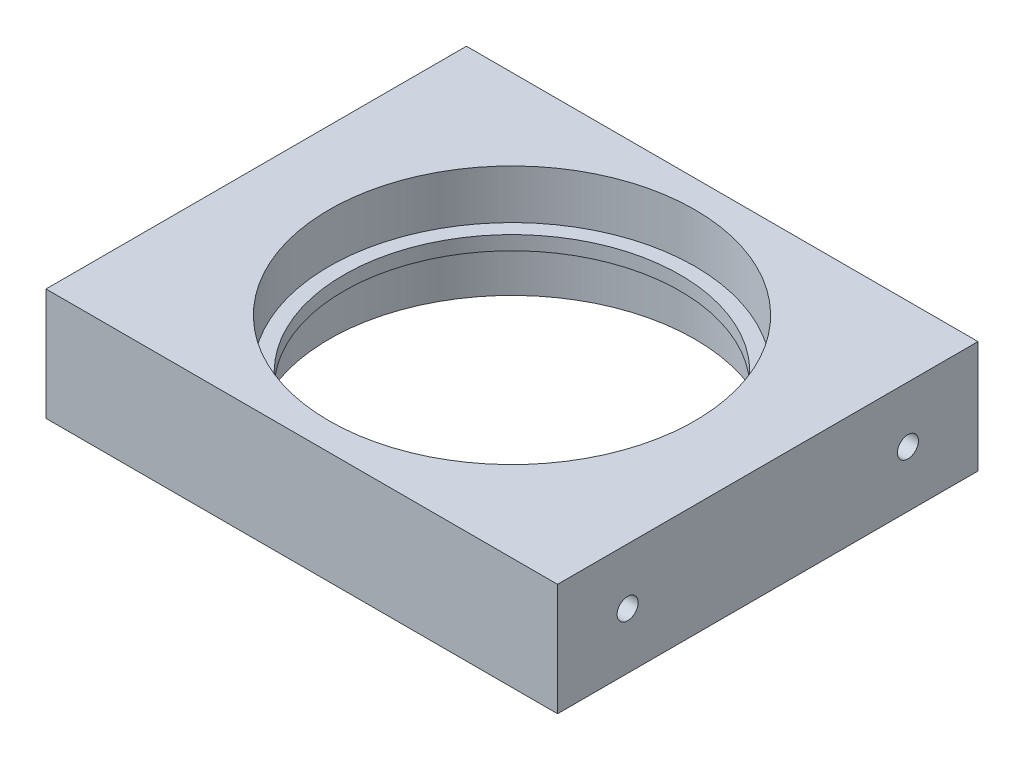
ISO-10303-21;
HEADER;
FILE_DESCRIPTION(('STEP AP214'),'2;1');
FILE_NAME('part.step','',(''),(''),'','','');
FILE_SCHEMA(('AUTOMOTIVE_DESIGN { 1 0 10303 214 1 1 1 1 }'));
ENDSEC;
DATA;
#1=APPLICATION_CONTEXT('core data for automotive mechanical design processes');
#2=APPLICATION_PROTOCOL_DEFINITION('international standard','automotive_design',2000,#1);
#3=PRODUCT_CONTEXT('',#1,'mechanical');
#4=PRODUCT('Part','Part','',(#3));
#5=PRODUCT_RELATED_PRODUCT_CATEGORY('part','',(#4));
#6=PRODUCT_DEFINITION_FORMATION('','',#4);
#7=PRODUCT_DEFINITION_CONTEXT('part definition',#1,'design');
#8=PRODUCT_DEFINITION('design','',#6,#7);
#9=PRODUCT_DEFINITION_SHAPE('','',#8);
#10=(LENGTH_UNIT() NAMED_UNIT(*) SI_UNIT(.MILLI.,.METRE.));
#11=(NAMED_UNIT(*) PLANE_ANGLE_UNIT() SI_UNIT($,.RADIAN.));
#12=(NAMED_UNIT(*) SI_UNIT($,.STERADIAN.) SOLID_ANGLE_UNIT());
#13=UNCERTAINTY_MEASURE_WITH_UNIT(LENGTH_MEASURE(1.E-05),#10,'distance_accuracy_value','');
#14=(GEOMETRIC_REPRESENTATION_CONTEXT(3) GLOBAL_UNCERTAINTY_ASSIGNED_CONTEXT((#13)) GLOBAL_UNIT_ASSIGNED_CONTEXT((#10,
#11,#12)) REPRESENTATION_CONTEXT('',''));
#15=CARTESIAN_POINT('',(0.,0.,0.));
#16=DIRECTION('',(0.,0.,1.));
#17=DIRECTION('',(1.,0.,0.));
#18=AXIS2_PLACEMENT_3D('',#15,#16,#17);
#19=CARTESIAN_POINT('',(36.5,16.,-30.));
#20=DIRECTION('',(0.,-1.,0.));
#21=DIRECTION('',(0.,0.,-1.));
#22=AXIS2_PLACEMENT_3D('',#19,#20,#21);
#23=CYLINDRICAL_SURFACE('',#22,26.1);
#24=CARTESIAN_POINT('',(36.5,0.,-30.));
#25=DIRECTION('',(0.,1.,0.));
#26=DIRECTION('',(0.,0.,1.));
#27=AXIS2_PLACEMENT_3D('',#24,#25,#26);
#28=CIRCLE('',#27,26.1);
#29=CARTESIAN_POINT('',(36.5,0.,-3.89999999999999));
#30=VERTEX_POINT('',#29);
#31=EDGE_CURVE('E155',#30,#30,#28,.T.);
#32=ORIENTED_EDGE('',*,*,#31,.F.);
#33=EDGE_LOOP('',(#32));
#34=FACE_BOUND('',#33,.T.);
#35=CARTESIAN_POINT('',(36.5,7.,-30.));
#36=DIRECTION('',(0.,1.,0.));
#37=DIRECTION('',(0.,0.,1.));
#38=AXIS2_PLACEMENT_3D('',#35,#36,#37);
#39=CIRCLE('',#38,26.1);
#40=CARTESIAN_POINT('',(36.5,7.,-3.89999999999999));
#41=VERTEX_POINT('',#40);
#42=EDGE_CURVE('E157',#41,#41,#39,.T.);
#43=ORIENTED_EDGE('',*,*,#42,.T.);
#44=EDGE_LOOP('',(#43));
#45=FACE_BOUND('',#44,.T.);
#46=ADVANCED_FACE('F51',(#34,#45),#23,.F.);
#47=CARTESIAN_POINT('',(0.,16.,0.));
#48=DIRECTION('',(0.,-1.,0.));
#49=DIRECTION('',(0.,0.,-1.));
#50=AXIS2_PLACEMENT_3D('',#47,#48,#49);
#51=PLANE('',#50);
#52=DIRECTION('',(0.,0.,1.));
#53=VECTOR('',#52,1.);
#54=CARTESIAN_POINT('',(0.,16.,0.));
#55=LINE('',#54,#53);
#56=CARTESIAN_POINT('',(0.,16.,-60.));
#57=VERTEX_POINT('',#56);
#58=CARTESIAN_POINT('',(0.,16.,0.));
#59=VERTEX_POINT('',#58);
#60=EDGE_CURVE('E108',#57,#59,#55,.T.);
#61=ORIENTED_EDGE('',*,*,#60,.T.);
#62=DIRECTION('',(1.,0.,0.));
#63=VECTOR('',#62,1.);
#64=CARTESIAN_POINT('',(0.,16.,0.));
#65=LINE('',#64,#63);
#66=CARTESIAN_POINT('',(73.,16.,0.));
#67=VERTEX_POINT('',#66);
#68=EDGE_CURVE('E102',#59,#67,#65,.T.);
#69=ORIENTED_EDGE('',*,*,#68,.T.);
#70=DIRECTION('',(0.,0.,-1.));
#71=VECTOR('',#70,1.);
#72=CARTESIAN_POINT('',(73.,16.,0.));
#73=LINE('',#72,#71);
#74=CARTESIAN_POINT('',(73.,16.,-60.));
#75=VERTEX_POINT('',#74);
#76=EDGE_CURVE('E106',#67,#75,#73,.T.);
#77=ORIENTED_EDGE('',*,*,#76,.T.);
#78=DIRECTION('',(-1.,0.,0.));
#79=VECTOR('',#78,1.);
#80=CARTESIAN_POINT('',(0.,16.,-60.));
#81=LINE('',#80,#79);
#82=EDGE_CURVE('E69',#75,#57,#81,.T.);
#83=ORIENTED_EDGE('',*,*,#82,.T.);
#84=EDGE_LOOP('',(#61,#69,#77,#83));
#85=FACE_BOUND('',#84,.T.);
#86=CARTESIAN_POINT('',(36.5,16.,-30.));
#87=DIRECTION('',(0.,1.,0.));
#88=DIRECTION('',(0.,0.,1.));
#89=AXIS2_PLACEMENT_3D('',#86,#87,#88);
#90=CIRCLE('',#89,26.1);
#91=CARTESIAN_POINT('',(36.5,16.,-3.89999999999999));
#92=VERTEX_POINT('',#91);
#93=EDGE_CURVE('E133',#92,#92,#90,.T.);
#94=ORIENTED_EDGE('',*,*,#93,.F.);
#95=EDGE_LOOP('',(#94));
#96=FACE_BOUND('',#95,.T.);
#97=ADVANCED_FACE('F103',(#85,#96),#51,.F.);
#98=CARTESIAN_POINT('',(0.,0.,0.));
#99=DIRECTION('',(0.,-1.,0.));
#100=DIRECTION('',(0.,0.,-1.));
#101=AXIS2_PLACEMENT_3D('',#98,#99,#100);
#102=PLANE('',#101);
#103=DIRECTION('',(0.,0.,1.));
#104=VECTOR('',#103,1.);
#105=CARTESIAN_POINT('',(0.,0.,0.));
#106=LINE('',#105,#104);
#107=CARTESIAN_POINT('',(0.,0.,-60.));
#108=VERTEX_POINT('',#107);
#109=CARTESIAN_POINT('',(0.,0.,0.));
#110=VERTEX_POINT('',#109);
#111=EDGE_CURVE('E129',#108,#110,#106,.T.);
#112=ORIENTED_EDGE('',*,*,#111,.F.);
#113=DIRECTION('',(-1.,0.,0.));
#114=VECTOR('',#113,1.);
#115=CARTESIAN_POINT('',(0.,0.,-60.));
#116=LINE('',#115,#114);
#117=CARTESIAN_POINT('',(73.,0.,-60.));
#118=VERTEX_POINT('',#117);
#119=EDGE_CURVE('E94',#118,#108,#116,.T.);
#120=ORIENTED_EDGE('',*,*,#119,.F.);
#121=DIRECTION('',(0.,0.,-1.));
#122=VECTOR('',#121,1.);
#123=CARTESIAN_POINT('',(73.,0.,0.));
#124=LINE('',#123,#122);
#125=CARTESIAN_POINT('',(73.,0.,0.));
#126=VERTEX_POINT('',#125);
#127=EDGE_CURVE('E88',#126,#118,#124,.T.);
#128=ORIENTED_EDGE('',*,*,#127,.F.);
#129=DIRECTION('',(1.,0.,0.));
#130=VECTOR('',#129,1.);
#131=CARTESIAN_POINT('',(0.,0.,0.));
#132=LINE('',#131,#130);
#133=EDGE_CURVE('E114',#110,#126,#132,.T.);
#134=ORIENTED_EDGE('',*,*,#133,.F.);
#135=EDGE_LOOP('',(#112,#120,#128,#134));
#136=FACE_BOUND('',#135,.T.);
#137=ORIENTED_EDGE('',*,*,#31,.T.);
#138=EDGE_LOOP('',(#137));
#139=FACE_BOUND('',#138,.T.);
#140=ADVANCED_FACE('F149',(#136,#139),#102,.T.);
#141=CARTESIAN_POINT('',(0.,16.,0.));
#142=DIRECTION('',(1.,0.,0.));
#143=DIRECTION('',(0.,0.,-1.));
#144=AXIS2_PLACEMENT_3D('',#141,#142,#143);
#145=PLANE('',#144);
#146=CARTESIAN_POINT('',(0.,8.,-10.));
#147=DIRECTION('',(1.,0.,0.));
#148=DIRECTION('',(0.,0.,-1.));
#149=AXIS2_PLACEMENT_3D('',#146,#147,#148);
#150=CIRCLE('',#149,1.5);
#151=CARTESIAN_POINT('',(0.,8.,-11.5));
#152=VERTEX_POINT('',#151);
#153=EDGE_CURVE('E196',#152,#152,#150,.T.);
#154=ORIENTED_EDGE('',*,*,#153,.T.);
#155=EDGE_LOOP('',(#154));
#156=FACE_BOUND('',#155,.T.);
#157=CARTESIAN_POINT('',(0.,8.,-50.));
#158=DIRECTION('',(1.,0.,0.));
#159=DIRECTION('',(0.,0.,-1.));
#160=AXIS2_PLACEMENT_3D('',#157,#158,#159);
#161=CIRCLE('',#160,1.5);
#162=CARTESIAN_POINT('',(0.,8.,-51.5));
#163=VERTEX_POINT('',#162);
#164=EDGE_CURVE('E204',#163,#163,#161,.T.);
#165=ORIENTED_EDGE('',*,*,#164,.T.);
#166=EDGE_LOOP('',(#165));
#167=FACE_BOUND('',#166,.T.);
#168=ORIENTED_EDGE('',*,*,#111,.T.);
#169=DIRECTION('',(0.,-1.,0.));
#170=VECTOR('',#169,1.);
#171=CARTESIAN_POINT('',(0.,16.,0.));
#172=LINE('',#171,#170);
#173=EDGE_CURVE('E61',#59,#110,#172,.T.);
#174=ORIENTED_EDGE('',*,*,#173,.F.);
#175=ORIENTED_EDGE('',*,*,#60,.F.);
#176=DIRECTION('',(0.,-1.,0.));
#177=VECTOR('',#176,1.);
#178=CARTESIAN_POINT('',(0.,16.,-60.));
#179=LINE('',#178,#177);
#180=EDGE_CURVE('E125',#57,#108,#179,.T.);
#181=ORIENTED_EDGE('',*,*,#180,.T.);
#182=EDGE_LOOP('',(#168,#174,#175,#181));
#183=FACE_BOUND('',#182,.T.);
#184=ADVANCED_FACE('F53',(#156,#167,#183),#145,.F.);
#185=CARTESIAN_POINT('',(0.,16.,0.));
#186=DIRECTION('',(0.,0.,-1.));
#187=DIRECTION('',(-1.,0.,0.));
#188=AXIS2_PLACEMENT_3D('',#185,#186,#187);
#189=PLANE('',#188);
#190=ORIENTED_EDGE('',*,*,#133,.T.);
#191=DIRECTION('',(0.,-1.,0.));
#192=VECTOR('',#191,1.);
#193=CARTESIAN_POINT('',(73.,16.,0.));
#194=LINE('',#193,#192);
#195=EDGE_CURVE('E112',#67,#126,#194,.T.);
#196=ORIENTED_EDGE('',*,*,#195,.F.);
#197=ORIENTED_EDGE('',*,*,#68,.F.);
#198=ORIENTED_EDGE('',*,*,#173,.T.);
#199=EDGE_LOOP('',(#190,#196,#197,#198));
#200=FACE_BOUND('',#199,.T.);
#201=ADVANCED_FACE('F113',(#200),#189,.F.);
#202=CARTESIAN_POINT('',(73.,16.,0.));
#203=DIRECTION('',(-1.,0.,0.));
#204=DIRECTION('',(0.,0.,1.));
#205=AXIS2_PLACEMENT_3D('',#202,#203,#204);
#206=PLANE('',#205);
#207=CARTESIAN_POINT('',(73.,8.,-10.));
#208=DIRECTION('',(1.,0.,0.));
#209=DIRECTION('',(0.,0.,-1.));
#210=AXIS2_PLACEMENT_3D('',#207,#208,#209);
#211=CIRCLE('',#210,1.5);
#212=CARTESIAN_POINT('',(73.,8.,-11.5));
#213=VERTEX_POINT('',#212);
#214=EDGE_CURVE('E171',#213,#213,#211,.T.);
#215=ORIENTED_EDGE('',*,*,#214,.F.);
#216=EDGE_LOOP('',(#215));
#217=FACE_BOUND('',#216,.T.);
#218=CARTESIAN_POINT('',(73.,8.,-50.));
#219=DIRECTION('',(1.,0.,0.));
#220=DIRECTION('',(0.,0.,-1.));
#221=AXIS2_PLACEMENT_3D('',#218,#219,#220);
#222=CIRCLE('',#221,1.5);
#223=CARTESIAN_POINT('',(73.,8.,-51.5));
#224=VERTEX_POINT('',#223);
#225=EDGE_CURVE('E169',#224,#224,#222,.T.);
#226=ORIENTED_EDGE('',*,*,#225,.F.);
#227=EDGE_LOOP('',(#226));
#228=FACE_BOUND('',#227,.T.);
#229=ORIENTED_EDGE('',*,*,#127,.T.);
#230=DIRECTION('',(0.,-1.,0.));
#231=VECTOR('',#230,1.);
#232=CARTESIAN_POINT('',(73.,16.,-60.));
#233=LINE('',#232,#231);
#234=EDGE_CURVE('E116',#75,#118,#233,.T.);
#235=ORIENTED_EDGE('',*,*,#234,.F.);
#236=ORIENTED_EDGE('',*,*,#76,.F.);
#237=ORIENTED_EDGE('',*,*,#195,.T.);
#238=EDGE_LOOP('',(#229,#235,#236,#237));
#239=FACE_BOUND('',#238,.T.);
#240=ADVANCED_FACE('F118',(#217,#228,#239),#206,.F.);
#241=CARTESIAN_POINT('',(0.,16.,-60.));
#242=DIRECTION('',(0.,0.,1.));
#243=DIRECTION('',(1.,0.,0.));
#244=AXIS2_PLACEMENT_3D('',#241,#242,#243);
#245=PLANE('',#244);
#246=ORIENTED_EDGE('',*,*,#119,.T.);
#247=ORIENTED_EDGE('',*,*,#180,.F.);
#248=ORIENTED_EDGE('',*,*,#82,.F.);
#249=ORIENTED_EDGE('',*,*,#234,.T.);
#250=EDGE_LOOP('',(#246,#247,#248,#249));
#251=FACE_BOUND('',#250,.T.);
#252=ADVANCED_FACE('F230',(#251),#245,.F.);
#253=CARTESIAN_POINT('',(36.5,9.,-30.));
#254=DIRECTION('',(0.,1.,0.));
#255=DIRECTION('',(0.,0.,1.));
#256=AXIS2_PLACEMENT_3D('',#253,#254,#255);
#257=CIRCLE('',#256,26.1);
#258=CARTESIAN_POINT('',(36.5,9.,-3.89999999999999));
#259=VERTEX_POINT('',#258);
#260=EDGE_CURVE('E11',#259,#259,#257,.T.);
#261=ORIENTED_EDGE('',*,*,#260,.F.);
#262=EDGE_LOOP('',(#261));
#263=FACE_BOUND('',#262,.T.);
#264=ORIENTED_EDGE('',*,*,#93,.T.);
#265=EDGE_LOOP('',(#264));
#266=FACE_BOUND('',#265,.T.);
#267=ADVANCED_FACE('F250',(#263,#266),#23,.F.);
#268=CARTESIAN_POINT('',(36.5,7.,-30.));
#269=DIRECTION('',(0.,1.,0.));
#270=DIRECTION('',(0.,0.,1.));
#271=AXIS2_PLACEMENT_3D('',#268,#269,#270);
#272=PLANE('',#271);
#273=CARTESIAN_POINT('',(36.5,7.,-30.));
#274=DIRECTION('',(0.,1.,0.));
#275=DIRECTION('',(0.,0.,1.));
#276=AXIS2_PLACEMENT_3D('',#273,#274,#275);
#277=CIRCLE('',#276,24.);
#278=CARTESIAN_POINT('',(36.5,7.,-6.));
#279=VERTEX_POINT('',#278);
#280=EDGE_CURVE('E165',#279,#279,#277,.T.);
#281=ORIENTED_EDGE('',*,*,#280,.T.);
#282=EDGE_LOOP('',(#281));
#283=FACE_BOUND('',#282,.T.);
#284=ORIENTED_EDGE('',*,*,#42,.F.);
#285=EDGE_LOOP('',(#284));
#286=FACE_BOUND('',#285,.T.);
#287=ADVANCED_FACE('F257',(#283,#286),#272,.F.);
#288=CARTESIAN_POINT('',(36.5,9.,-30.));
#289=DIRECTION('',(0.,1.,0.));
#290=DIRECTION('',(0.,0.,1.));
#291=AXIS2_PLACEMENT_3D('',#288,#289,#290);
#292=PLANE('',#291);
#293=CARTESIAN_POINT('',(36.5,9.,-30.));
#294=DIRECTION('',(0.,1.,0.));
#295=DIRECTION('',(0.,0.,1.));
#296=AXIS2_PLACEMENT_3D('',#293,#294,#295);
#297=CIRCLE('',#296,24.);
#298=CARTESIAN_POINT('',(36.5,9.,-6.));
#299=VERTEX_POINT('',#298);
#300=EDGE_CURVE('E187',#299,#299,#297,.T.);
#301=ORIENTED_EDGE('',*,*,#300,.F.);
#302=EDGE_LOOP('',(#301));
#303=FACE_BOUND('',#302,.T.);
#304=ORIENTED_EDGE('',*,*,#260,.T.);
#305=EDGE_LOOP('',(#304));
#306=FACE_BOUND('',#305,.T.);
#307=ADVANCED_FACE('F244',(#303,#306),#292,.T.);
#308=CARTESIAN_POINT('',(36.5,7.,-30.));
#309=DIRECTION('',(0.,1.,0.));
#310=DIRECTION('',(0.,0.,1.));
#311=AXIS2_PLACEMENT_3D('',#308,#309,#310);
#312=CYLINDRICAL_SURFACE('',#311,24.);
#313=ORIENTED_EDGE('',*,*,#280,.F.);
#314=EDGE_LOOP('',(#313));
#315=FACE_BOUND('',#314,.T.);
#316=ORIENTED_EDGE('',*,*,#300,.T.);
#317=EDGE_LOOP('',(#316));
#318=FACE_BOUND('',#317,.T.);
#319=ADVANCED_FACE('F236',(#315,#318),#312,.F.);
#320=CARTESIAN_POINT('',(58.,8.,-50.));
#321=DIRECTION('',(1.,0.,0.));
#322=DIRECTION('',(0.,0.,-1.));
#323=AXIS2_PLACEMENT_3D('',#320,#321,#322);
#324=CYLINDRICAL_SURFACE('',#323,1.5);
#325=CARTESIAN_POINT('',(58.,8.,-50.));
#326=DIRECTION('',(1.,0.,0.));
#327=DIRECTION('',(0.,0.,-1.));
#328=AXIS2_PLACEMENT_3D('',#325,#326,#327);
#329=CIRCLE('',#328,1.5);
#330=CARTESIAN_POINT('',(58.,8.,-51.5));
#331=VERTEX_POINT('',#330);
#332=EDGE_CURVE('E172',#331,#331,#329,.T.);
#333=ORIENTED_EDGE('',*,*,#332,.F.);
#334=EDGE_LOOP('',(#333));
#335=FACE_BOUND('',#334,.T.);
#336=ORIENTED_EDGE('',*,*,#225,.T.);
#337=EDGE_LOOP('',(#336));
#338=FACE_BOUND('',#337,.T.);
#339=ADVANCED_FACE('F234',(#335,#338),#324,.F.);
#340=CARTESIAN_POINT('',(58.,8.,-50.));
#341=DIRECTION('',(1.,0.,0.));
#342=DIRECTION('',(0.,0.,-1.));
#343=AXIS2_PLACEMENT_3D('',#340,#341,#342);
#344=PLANE('',#343);
#345=ORIENTED_EDGE('',*,*,#332,.T.);
#346=EDGE_LOOP('',(#345));
#347=FACE_BOUND('',#346,.T.);
#348=ADVANCED_FACE('F224',(#347),#344,.T.);
#349=CARTESIAN_POINT('',(58.,8.,-10.));
#350=DIRECTION('',(1.,0.,0.));
#351=DIRECTION('',(0.,0.,-1.));
#352=AXIS2_PLACEMENT_3D('',#349,#350,#351);
#353=CYLINDRICAL_SURFACE('',#352,1.5);
#354=CARTESIAN_POINT('',(58.,8.,-10.));
#355=DIRECTION('',(1.,0.,0.));
#356=DIRECTION('',(0.,0.,-1.));
#357=AXIS2_PLACEMENT_3D('',#354,#355,#356);
#358=CIRCLE('',#357,1.5);
#359=CARTESIAN_POINT('',(58.,8.,-11.5));
#360=VERTEX_POINT('',#359);
#361=EDGE_CURVE('E194',#360,#360,#358,.T.);
#362=ORIENTED_EDGE('',*,*,#361,.F.);
#363=EDGE_LOOP('',(#362));
#364=FACE_BOUND('',#363,.T.);
#365=ORIENTED_EDGE('',*,*,#214,.T.);
#366=EDGE_LOOP('',(#365));
#367=FACE_BOUND('',#366,.T.);
#368=ADVANCED_FACE('F221',(#364,#367),#353,.F.);
#369=CARTESIAN_POINT('',(58.,8.,-10.));
#370=DIRECTION('',(1.,0.,0.));
#371=DIRECTION('',(0.,0.,-1.));
#372=AXIS2_PLACEMENT_3D('',#369,#370,#371);
#373=PLANE('',#372);
#374=ORIENTED_EDGE('',*,*,#361,.T.);
#375=EDGE_LOOP('',(#374));
#376=FACE_BOUND('',#375,.T.);
#377=ADVANCED_FACE('F219',(#376),#373,.T.);
#378=CARTESIAN_POINT('',(15.,8.,-50.));
#379=DIRECTION('',(-1.,0.,0.));
#380=DIRECTION('',(0.,0.,1.));
#381=AXIS2_PLACEMENT_3D('',#378,#379,#380);
#382=CYLINDRICAL_SURFACE('',#381,1.5);
#383=CARTESIAN_POINT('',(15.,8.,-50.));
#384=DIRECTION('',(1.,0.,0.));
#385=DIRECTION('',(0.,0.,-1.));
#386=AXIS2_PLACEMENT_3D('',#383,#384,#385);
#387=CIRCLE('',#386,1.5);
#388=CARTESIAN_POINT('',(15.,8.,-51.5));
#389=VERTEX_POINT('',#388);
#390=EDGE_CURVE('E198',#389,#389,#387,.T.);
#391=ORIENTED_EDGE('',*,*,#390,.T.);
#392=EDGE_LOOP('',(#391));
#393=FACE_BOUND('',#392,.T.);
#394=ORIENTED_EDGE('',*,*,#164,.F.);
#395=EDGE_LOOP('',(#394));
#396=FACE_BOUND('',#395,.T.);
#397=ADVANCED_FACE('F315',(#393,#396),#382,.F.);
#398=CARTESIAN_POINT('',(15.,8.,-50.));
#399=DIRECTION('',(1.,0.,0.));
#400=DIRECTION('',(0.,0.,-1.));
#401=AXIS2_PLACEMENT_3D('',#398,#399,#400);
#402=PLANE('',#401);
#403=ORIENTED_EDGE('',*,*,#390,.F.);
#404=EDGE_LOOP('',(#403));
#405=FACE_BOUND('',#404,.T.);
#406=ADVANCED_FACE('F333',(#405),#402,.F.);
#407=CARTESIAN_POINT('',(15.,8.,-10.));
#408=DIRECTION('',(-1.,0.,0.));
#409=DIRECTION('',(0.,0.,1.));
#410=AXIS2_PLACEMENT_3D('',#407,#408,#409);
#411=CYLINDRICAL_SURFACE('',#410,1.5);
#412=CARTESIAN_POINT('',(15.,8.,-10.));
#413=DIRECTION('',(1.,0.,0.));
#414=DIRECTION('',(0.,0.,-1.));
#415=AXIS2_PLACEMENT_3D('',#412,#413,#414);
#416=CIRCLE('',#415,1.5);
#417=CARTESIAN_POINT('',(15.,8.,-11.5));
#418=VERTEX_POINT('',#417);
#419=EDGE_CURVE('E182',#418,#418,#416,.T.);
#420=ORIENTED_EDGE('',*,*,#419,.T.);
#421=EDGE_LOOP('',(#420));
#422=FACE_BOUND('',#421,.T.);
#423=ORIENTED_EDGE('',*,*,#153,.F.);
#424=EDGE_LOOP('',(#423));
#425=FACE_BOUND('',#424,.T.);
#426=ADVANCED_FACE('F343',(#422,#425),#411,.F.);
#427=CARTESIAN_POINT('',(15.,8.,-10.));
#428=DIRECTION('',(1.,0.,0.));
#429=DIRECTION('',(0.,0.,-1.));
#430=AXIS2_PLACEMENT_3D('',#427,#428,#429);
#431=PLANE('',#430);
#432=ORIENTED_EDGE('',*,*,#419,.F.);
#433=EDGE_LOOP('',(#432));
#434=FACE_BOUND('',#433,.T.);
#435=ADVANCED_FACE('F353',(#434),#431,.F.);
#436=CLOSED_SHELL('',(#46,#97,#140,#184,#201,#240,#252,#267,#287,#307,#319,#339,#348,#368,#377,
#397,#406,#426,#435));
#437=MANIFOLD_SOLID_BREP('B2',#436);
#438=ADVANCED_BREP_SHAPE_REPRESENTATION('',(#18,#437),#14);
#439=SHAPE_DEFINITION_REPRESENTATION(#9,#438);
ENDSEC;
END-ISO-10303-21;
